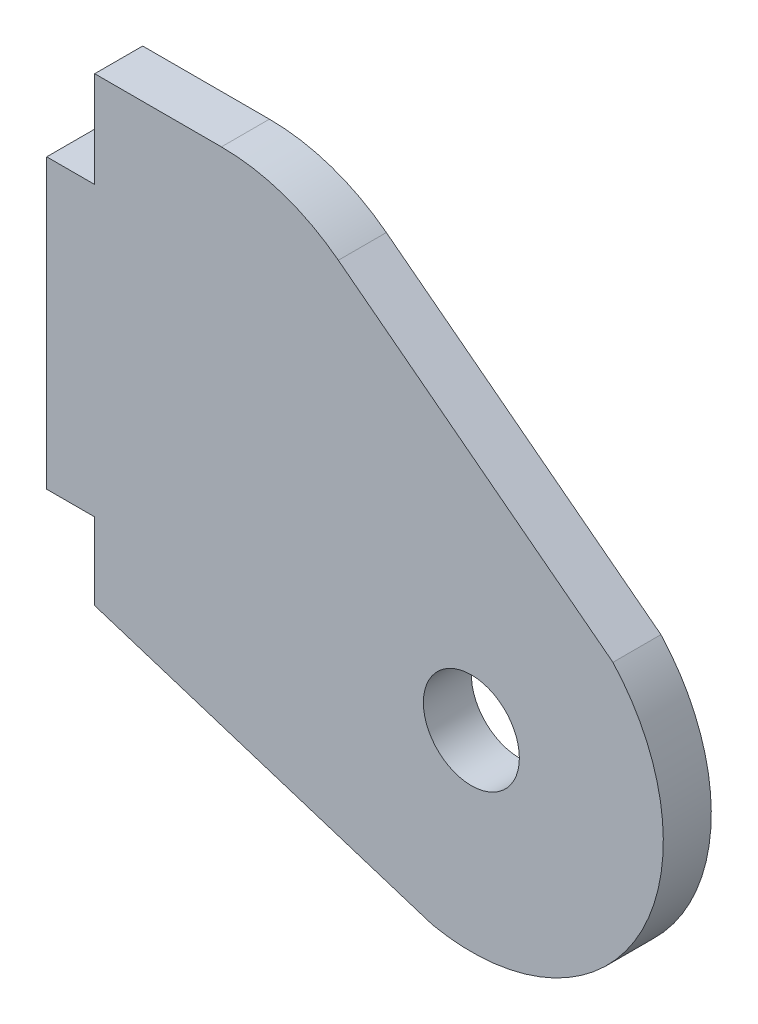
ISO-10303-21;
HEADER;
FILE_DESCRIPTION(('STEP AP214'),'2;1');
FILE_NAME('part.step','',(''),(''),'','','');
FILE_SCHEMA(('AUTOMOTIVE_DESIGN { 1 0 10303 214 1 1 1 1 }'));
ENDSEC;
DATA;
#1=APPLICATION_CONTEXT('core data for automotive mechanical design processes');
#2=APPLICATION_PROTOCOL_DEFINITION('international standard','automotive_design',2000,#1);
#3=PRODUCT_CONTEXT('',#1,'mechanical');
#4=PRODUCT('Part','Part','',(#3));
#5=PRODUCT_RELATED_PRODUCT_CATEGORY('part','',(#4));
#6=PRODUCT_DEFINITION_FORMATION('','',#4);
#7=PRODUCT_DEFINITION_CONTEXT('part definition',#1,'design');
#8=PRODUCT_DEFINITION('design','',#6,#7);
#9=PRODUCT_DEFINITION_SHAPE('','',#8);
#10=(LENGTH_UNIT() NAMED_UNIT(*) SI_UNIT(.MILLI.,.METRE.));
#11=(NAMED_UNIT(*) PLANE_ANGLE_UNIT() SI_UNIT($,.RADIAN.));
#12=(NAMED_UNIT(*) SI_UNIT($,.STERADIAN.) SOLID_ANGLE_UNIT());
#13=UNCERTAINTY_MEASURE_WITH_UNIT(LENGTH_MEASURE(1.E-05),#10,'distance_accuracy_value','');
#14=(GEOMETRIC_REPRESENTATION_CONTEXT(3) GLOBAL_UNCERTAINTY_ASSIGNED_CONTEXT((#13)) GLOBAL_UNIT_ASSIGNED_CONTEXT((#10,
#11,#12)) REPRESENTATION_CONTEXT('',''));
#15=CARTESIAN_POINT('',(0.,0.,0.));
#16=DIRECTION('',(0.,0.,1.));
#17=DIRECTION('',(1.,0.,0.));
#18=AXIS2_PLACEMENT_3D('',#15,#16,#17);
#19=CARTESIAN_POINT('',(-26.2895002274562,-6.08181524735568,-3.175));
#20=DIRECTION('',(1.,0.,0.));
#21=DIRECTION('',(0.,0.,1.));
#22=AXIS2_PLACEMENT_3D('',#19,#20,#21);
#23=PLANE('',#22);
#24=DIRECTION('',(0.,-1.,0.));
#25=VECTOR('',#24,1.);
#26=CARTESIAN_POINT('',(-26.2895002274562,-6.08181524735568,0.));
#27=LINE('',#26,#25);
#28=CARTESIAN_POINT('',(-26.2895002274562,-6.08181524735568,0.));
#29=VERTEX_POINT('',#28);
#30=CARTESIAN_POINT('',(-26.2895002274562,-12.4318152473557,0.));
#31=VERTEX_POINT('',#30);
#32=EDGE_CURVE('E162',#29,#31,#27,.T.);
#33=ORIENTED_EDGE('',*,*,#32,.F.);
#34=DIRECTION('',(0.,0.,1.));
#35=VECTOR('',#34,1.);
#36=CARTESIAN_POINT('',(-26.2895002274562,-6.08181524735568,-3.175));
#37=LINE('',#36,#35);
#38=CARTESIAN_POINT('',(-26.2895002274562,-6.08181524735568,-3.175));
#39=VERTEX_POINT('',#38);
#40=EDGE_CURVE('E135',#39,#29,#37,.T.);
#41=ORIENTED_EDGE('',*,*,#40,.F.);
#42=DIRECTION('',(0.,-1.,0.));
#43=VECTOR('',#42,1.);
#44=CARTESIAN_POINT('',(-26.2895002274562,-6.08181524735568,-3.175));
#45=LINE('',#44,#43);
#46=CARTESIAN_POINT('',(-26.2895002274562,-12.4318152473557,-3.175));
#47=VERTEX_POINT('',#46);
#48=EDGE_CURVE('E115',#39,#47,#45,.T.);
#49=ORIENTED_EDGE('',*,*,#48,.T.);
#50=DIRECTION('',(0.,0.,1.));
#51=VECTOR('',#50,1.);
#52=CARTESIAN_POINT('',(-26.2895002274562,-12.4318152473557,-3.175));
#53=LINE('',#52,#51);
#54=EDGE_CURVE('E124',#47,#31,#53,.T.);
#55=ORIENTED_EDGE('',*,*,#54,.T.);
#56=EDGE_LOOP('',(#33,#41,#49,#55));
#57=FACE_BOUND('',#56,.T.);
#58=ADVANCED_FACE('F37',(#57),#23,.F.);
#59=CARTESIAN_POINT('',(-29.4645002274562,-12.4318152473557,-3.175));
#60=DIRECTION('',(0.,-1.,0.));
#61=DIRECTION('',(0.,0.,1.));
#62=AXIS2_PLACEMENT_3D('',#59,#60,#61);
#63=PLANE('',#62);
#64=DIRECTION('',(-1.,0.,0.));
#65=VECTOR('',#64,1.);
#66=CARTESIAN_POINT('',(-29.4645002274562,-12.4318152473557,0.));
#67=LINE('',#66,#65);
#68=CARTESIAN_POINT('',(-29.4645002274562,-12.4318152473557,0.));
#69=VERTEX_POINT('',#68);
#70=EDGE_CURVE('E127',#31,#69,#67,.T.);
#71=ORIENTED_EDGE('',*,*,#70,.F.);
#72=ORIENTED_EDGE('',*,*,#54,.F.);
#73=DIRECTION('',(-1.,0.,0.));
#74=VECTOR('',#73,1.);
#75=CARTESIAN_POINT('',(-29.4645002274562,-12.4318152473557,-3.175));
#76=LINE('',#75,#74);
#77=CARTESIAN_POINT('',(-29.4645002274562,-12.4318152473557,-3.175));
#78=VERTEX_POINT('',#77);
#79=EDGE_CURVE('E111',#47,#78,#76,.T.);
#80=ORIENTED_EDGE('',*,*,#79,.T.);
#81=DIRECTION('',(0.,0.,1.));
#82=VECTOR('',#81,1.);
#83=CARTESIAN_POINT('',(-29.4645002274562,-12.4318152473557,-3.175));
#84=LINE('',#83,#82);
#85=EDGE_CURVE('E132',#78,#69,#84,.T.);
#86=ORIENTED_EDGE('',*,*,#85,.T.);
#87=EDGE_LOOP('',(#71,#72,#80,#86));
#88=FACE_BOUND('',#87,.T.);
#89=ADVANCED_FACE('F125',(#88),#63,.F.);
#90=CARTESIAN_POINT('',(-29.4645002274562,-31.4818152473557,-3.175));
#91=DIRECTION('',(1.,0.,0.));
#92=DIRECTION('',(0.,0.,1.));
#93=AXIS2_PLACEMENT_3D('',#90,#91,#92);
#94=PLANE('',#93);
#95=DIRECTION('',(0.,-1.,0.));
#96=VECTOR('',#95,1.);
#97=CARTESIAN_POINT('',(-29.4645002274562,-31.4818152473557,0.));
#98=LINE('',#97,#96);
#99=CARTESIAN_POINT('',(-29.4645002274562,-31.4818152473557,0.));
#100=VERTEX_POINT('',#99);
#101=EDGE_CURVE('E165',#69,#100,#98,.T.);
#102=ORIENTED_EDGE('',*,*,#101,.F.);
#103=ORIENTED_EDGE('',*,*,#85,.F.);
#104=DIRECTION('',(0.,-1.,0.));
#105=VECTOR('',#104,1.);
#106=CARTESIAN_POINT('',(-29.4645002274562,-31.4818152473557,-3.175));
#107=LINE('',#106,#105);
#108=CARTESIAN_POINT('',(-29.4645002274562,-31.4818152473557,-3.175));
#109=VERTEX_POINT('',#108);
#110=EDGE_CURVE('E118',#78,#109,#107,.T.);
#111=ORIENTED_EDGE('',*,*,#110,.T.);
#112=DIRECTION('',(0.,0.,1.));
#113=VECTOR('',#112,1.);
#114=CARTESIAN_POINT('',(-29.4645002274562,-31.4818152473557,-3.175));
#115=LINE('',#114,#113);
#116=EDGE_CURVE('E195',#109,#100,#115,.T.);
#117=ORIENTED_EDGE('',*,*,#116,.T.);
#118=EDGE_LOOP('',(#102,#103,#111,#117));
#119=FACE_BOUND('',#118,.T.);
#120=ADVANCED_FACE('F217',(#119),#94,.F.);
#121=CARTESIAN_POINT('',(-26.2895002274562,-31.4818152473557,-3.175));
#122=DIRECTION('',(0.,1.,0.));
#123=DIRECTION('',(0.,0.,-1.));
#124=AXIS2_PLACEMENT_3D('',#121,#122,#123);
#125=PLANE('',#124);
#126=DIRECTION('',(1.,0.,0.));
#127=VECTOR('',#126,1.);
#128=CARTESIAN_POINT('',(-26.2895002274562,-31.4818152473557,0.));
#129=LINE('',#128,#127);
#130=CARTESIAN_POINT('',(-26.2895002274562,-31.4818152473557,0.));
#131=VERTEX_POINT('',#130);
#132=EDGE_CURVE('E168',#100,#131,#129,.T.);
#133=ORIENTED_EDGE('',*,*,#132,.F.);
#134=ORIENTED_EDGE('',*,*,#116,.F.);
#135=DIRECTION('',(1.,0.,0.));
#136=VECTOR('',#135,1.);
#137=CARTESIAN_POINT('',(-26.2895002274562,-31.4818152473557,-3.175));
#138=LINE('',#137,#136);
#139=CARTESIAN_POINT('',(-26.2895002274562,-31.4818152473557,-3.175));
#140=VERTEX_POINT('',#139);
#141=EDGE_CURVE('E145',#109,#140,#138,.T.);
#142=ORIENTED_EDGE('',*,*,#141,.T.);
#143=DIRECTION('',(0.,0.,1.));
#144=VECTOR('',#143,1.);
#145=CARTESIAN_POINT('',(-26.2895002274562,-31.4818152473557,-3.175));
#146=LINE('',#145,#144);
#147=EDGE_CURVE('E192',#140,#131,#146,.T.);
#148=ORIENTED_EDGE('',*,*,#147,.T.);
#149=EDGE_LOOP('',(#133,#134,#142,#148));
#150=FACE_BOUND('',#149,.T.);
#151=ADVANCED_FACE('F215',(#150),#125,.F.);
#152=CARTESIAN_POINT('',(-26.2895002274562,-31.4818152473557,-3.175));
#153=DIRECTION('',(1.,0.,0.));
#154=DIRECTION('',(0.,1.,0.));
#155=AXIS2_PLACEMENT_3D('',#152,#153,#154);
#156=PLANE('',#155);
#157=DIRECTION('',(0.,-1.,0.));
#158=VECTOR('',#157,1.);
#159=CARTESIAN_POINT('',(-26.2895002274562,-31.4818152473557,0.));
#160=LINE('',#159,#158);
#161=CARTESIAN_POINT('',(-26.2895002274562,-36.5618152473557,0.));
#162=VERTEX_POINT('',#161);
#163=EDGE_CURVE('E171',#131,#162,#160,.T.);
#164=ORIENTED_EDGE('',*,*,#163,.F.);
#165=ORIENTED_EDGE('',*,*,#147,.F.);
#166=DIRECTION('',(0.,-1.,0.));
#167=VECTOR('',#166,1.);
#168=CARTESIAN_POINT('',(-26.2895002274562,-31.4818152473557,-3.175));
#169=LINE('',#168,#167);
#170=CARTESIAN_POINT('',(-26.2895002274562,-36.5618152473557,-3.175));
#171=VERTEX_POINT('',#170);
#172=EDGE_CURVE('E148',#140,#171,#169,.T.);
#173=ORIENTED_EDGE('',*,*,#172,.T.);
#174=DIRECTION('',(0.,0.,1.));
#175=VECTOR('',#174,1.);
#176=CARTESIAN_POINT('',(-26.2895002274562,-36.5618152473557,-3.175));
#177=LINE('',#176,#175);
#178=EDGE_CURVE('E189',#171,#162,#177,.T.);
#179=ORIENTED_EDGE('',*,*,#178,.T.);
#180=EDGE_LOOP('',(#164,#165,#173,#179));
#181=FACE_BOUND('',#180,.T.);
#182=ADVANCED_FACE('F212',(#181),#156,.F.);
#183=CARTESIAN_POINT('',(-26.2895002274562,-36.5618152473557,-3.175));
#184=DIRECTION('',(0.303441198287286,0.952850166176181,0.));
#185=DIRECTION('',(-0.952850166176181,0.303441198287286,0.));
#186=AXIS2_PLACEMENT_3D('',#183,#184,#185);
#187=PLANE('',#186);
#188=DIRECTION('',(0.952850166176181,-0.303441198287286,0.));
#189=VECTOR('',#188,1.);
#190=CARTESIAN_POINT('',(-26.2895002274562,-36.5618152473557,0.));
#191=LINE('',#190,#189);
#192=CARTESIAN_POINT('',(-3.93750022745617,-43.6799518703841,0.));
#193=VERTEX_POINT('',#192);
#194=EDGE_CURVE('E174',#162,#193,#191,.T.);
#195=ORIENTED_EDGE('',*,*,#194,.F.);
#196=ORIENTED_EDGE('',*,*,#178,.F.);
#197=DIRECTION('',(0.952850166176181,-0.303441198287286,0.));
#198=VECTOR('',#197,1.);
#199=CARTESIAN_POINT('',(-26.2895002274562,-36.5618152473557,-3.175));
#200=LINE('',#199,#198);
#201=CARTESIAN_POINT('',(-3.93750022745617,-43.6799518703841,-3.175));
#202=VERTEX_POINT('',#201);
#203=EDGE_CURVE('E151',#171,#202,#200,.T.);
#204=ORIENTED_EDGE('',*,*,#203,.T.);
#205=DIRECTION('',(0.,0.,1.));
#206=VECTOR('',#205,1.);
#207=CARTESIAN_POINT('',(-3.93750022745617,-43.6799518703841,-3.175));
#208=LINE('',#207,#206);
#209=EDGE_CURVE('E186',#202,#193,#208,.T.);
#210=ORIENTED_EDGE('',*,*,#209,.T.);
#211=EDGE_LOOP('',(#195,#196,#204,#210));
#212=FACE_BOUND('',#211,.T.);
#213=ADVANCED_FACE('F209',(#212),#187,.F.);
#214=CARTESIAN_POINT('',(-1.36575022745629,-31.2430671343459,-3.175));
#215=DIRECTION('',(0.,0.,1.));
#216=DIRECTION('',(-1.,0.,0.));
#217=AXIS2_PLACEMENT_3D('',#214,#215,#216);
#218=CYLINDRICAL_SURFACE('',#217,12.7);
#219=CARTESIAN_POINT('',(-1.36575022745629,-31.2430671343459,0.));
#220=DIRECTION('',(0.,0.,1.));
#221=DIRECTION('',(-1.,0.,0.));
#222=AXIS2_PLACEMENT_3D('',#219,#220,#221);
#223=CIRCLE('',#222,12.7);
#224=CARTESIAN_POINT('',(8.00049977254384,-22.6661585457286,0.));
#225=VERTEX_POINT('',#224);
#226=EDGE_CURVE('E177',#193,#225,#223,.T.);
#227=ORIENTED_EDGE('',*,*,#226,.F.);
#228=ORIENTED_EDGE('',*,*,#209,.F.);
#229=CARTESIAN_POINT('',(-1.36575022745629,-31.2430671343459,-3.175));
#230=DIRECTION('',(0.,0.,1.));
#231=DIRECTION('',(-1.,0.,0.));
#232=AXIS2_PLACEMENT_3D('',#229,#230,#231);
#233=CIRCLE('',#232,12.7);
#234=CARTESIAN_POINT('',(8.00049977254384,-22.6661585457286,-3.175));
#235=VERTEX_POINT('',#234);
#236=EDGE_CURVE('E154',#202,#235,#233,.T.);
#237=ORIENTED_EDGE('',*,*,#236,.T.);
#238=DIRECTION('',(0.,0.,1.));
#239=VECTOR('',#238,1.);
#240=CARTESIAN_POINT('',(8.00049977254384,-22.6661585457286,-3.175));
#241=LINE('',#240,#239);
#242=EDGE_CURVE('E183',#235,#225,#241,.T.);
#243=ORIENTED_EDGE('',*,*,#242,.T.);
#244=EDGE_LOOP('',(#227,#228,#237,#243));
#245=FACE_BOUND('',#244,.T.);
#246=ADVANCED_FACE('F207',(#245),#218,.T.);
#247=CARTESIAN_POINT('',(-13.5895002274562,-6.08181524735568,-3.175));
#248=DIRECTION('',(-0.609171799118422,-0.793038283539215,0.));
#249=DIRECTION('',(0.793038283539216,-0.609171799118422,0.));
#250=AXIS2_PLACEMENT_3D('',#247,#248,#249);
#251=PLANE('',#250);
#252=DIRECTION('',(-0.793038283539215,0.609171799118422,0.));
#253=VECTOR('',#252,1.);
#254=CARTESIAN_POINT('',(-13.5895002274562,-6.08181524735568,0.));
#255=LINE('',#254,#253);
#256=CARTESIAN_POINT('',(-10.1677515998153,-8.71022904640765,0.));
#257=VERTEX_POINT('',#256);
#258=EDGE_CURVE('E138',#225,#257,#255,.T.);
#259=ORIENTED_EDGE('',*,*,#258,.F.);
#260=ORIENTED_EDGE('',*,*,#242,.F.);
#261=DIRECTION('',(-0.793038283539215,0.609171799118422,0.));
#262=VECTOR('',#261,1.);
#263=CARTESIAN_POINT('',(-13.5895002274562,-6.08181524735568,-3.175));
#264=LINE('',#263,#262);
#265=CARTESIAN_POINT('',(-10.1677515998153,-8.71022904640765,-3.175));
#266=VERTEX_POINT('',#265);
#267=EDGE_CURVE('E157',#235,#266,#264,.T.);
#268=ORIENTED_EDGE('',*,*,#267,.T.);
#269=DIRECTION('',(0.,0.,1.));
#270=VECTOR('',#269,1.);
#271=CARTESIAN_POINT('',(-10.1677515998153,-8.71022904640765,-3.175));
#272=LINE('',#271,#270);
#273=EDGE_CURVE('E45',#257,#266,#272,.F.);
#274=ORIENTED_EDGE('',*,*,#273,.F.);
#275=EDGE_LOOP('',(#259,#260,#268,#274));
#276=FACE_BOUND('',#275,.T.);
#277=ADVANCED_FACE('F203',(#276),#251,.F.);
#278=CARTESIAN_POINT('',(-26.2895002274562,-6.08181524735568,-3.175));
#279=DIRECTION('',(0.,-1.,0.));
#280=DIRECTION('',(0.,0.,1.));
#281=AXIS2_PLACEMENT_3D('',#278,#279,#280);
#282=PLANE('',#281);
#283=DIRECTION('',(-1.,0.,0.));
#284=VECTOR('',#283,1.);
#285=CARTESIAN_POINT('',(-26.2895002274562,-6.08181524735568,-3.175));
#286=LINE('',#285,#284);
#287=CARTESIAN_POINT('',(-17.9042334486193,-6.08181524735568,-3.175));
#288=VERTEX_POINT('',#287);
#289=EDGE_CURVE('E160',#288,#39,#286,.T.);
#290=ORIENTED_EDGE('',*,*,#289,.T.);
#291=ORIENTED_EDGE('',*,*,#40,.T.);
#292=DIRECTION('',(-1.,0.,0.));
#293=VECTOR('',#292,1.);
#294=CARTESIAN_POINT('',(-26.2895002274562,-6.08181524735568,0.));
#295=LINE('',#294,#293);
#296=CARTESIAN_POINT('',(-17.9042334486193,-6.08181524735568,0.));
#297=VERTEX_POINT('',#296);
#298=EDGE_CURVE('E136',#297,#29,#295,.T.);
#299=ORIENTED_EDGE('',*,*,#298,.F.);
#300=DIRECTION('',(0.,0.,1.));
#301=VECTOR('',#300,1.);
#302=CARTESIAN_POINT('',(-17.9042334486193,-6.08181524735568,-3.175));
#303=LINE('',#302,#301);
#304=EDGE_CURVE('E131',#288,#297,#303,.T.);
#305=ORIENTED_EDGE('',*,*,#304,.F.);
#306=EDGE_LOOP('',(#290,#291,#299,#305));
#307=FACE_BOUND('',#306,.T.);
#308=ADVANCED_FACE('F222',(#307),#282,.F.);
#309=CARTESIAN_POINT('',(-1.36575022745629,-31.2430671343459,-3.175));
#310=DIRECTION('',(0.,0.,1.));
#311=DIRECTION('',(-1.,0.,0.));
#312=AXIS2_PLACEMENT_3D('',#309,#310,#311);
#313=PLANE('',#312);
#314=CARTESIAN_POINT('',(-1.36575022745629,-31.2430671343459,-3.175));
#315=DIRECTION('',(0.,0.,1.));
#316=DIRECTION('',(1.,0.,0.));
#317=AXIS2_PLACEMENT_3D('',#314,#315,#316);
#318=CIRCLE('',#317,3.175);
#319=CARTESIAN_POINT('',(1.80924977254371,-31.2430671343459,-3.175));
#320=VERTEX_POINT('',#319);
#321=EDGE_CURVE('E300',#320,#320,#318,.T.);
#322=ORIENTED_EDGE('',*,*,#321,.T.);
#323=EDGE_LOOP('',(#322));
#324=FACE_BOUND('',#323,.T.);
#325=ORIENTED_EDGE('',*,*,#267,.F.);
#326=ORIENTED_EDGE('',*,*,#236,.F.);
#327=ORIENTED_EDGE('',*,*,#203,.F.);
#328=ORIENTED_EDGE('',*,*,#172,.F.);
#329=ORIENTED_EDGE('',*,*,#141,.F.);
#330=ORIENTED_EDGE('',*,*,#110,.F.);
#331=ORIENTED_EDGE('',*,*,#79,.F.);
#332=ORIENTED_EDGE('',*,*,#48,.F.);
#333=ORIENTED_EDGE('',*,*,#289,.F.);
#334=CARTESIAN_POINT('',(-17.9042334486193,-18.7818152473557,-3.175));
#335=DIRECTION('',(0.,0.,-1.));
#336=DIRECTION('',(-1.,0.,0.));
#337=AXIS2_PLACEMENT_3D('',#334,#335,#336);
#338=CIRCLE('',#337,12.7);
#339=EDGE_CURVE('E11',#266,#288,#338,.F.);
#340=ORIENTED_EDGE('',*,*,#339,.F.);
#341=EDGE_LOOP('',(#325,#326,#327,#328,#329,#330,#331,#332,#333,#340));
#342=FACE_BOUND('',#341,.T.);
#343=ADVANCED_FACE('F113',(#324,#342),#313,.F.);
#344=CARTESIAN_POINT('',(-1.36575022745629,-31.2430671343459,0.));
#345=DIRECTION('',(0.,0.,1.));
#346=DIRECTION('',(-1.,0.,0.));
#347=AXIS2_PLACEMENT_3D('',#344,#345,#346);
#348=PLANE('',#347);
#349=CARTESIAN_POINT('',(-1.36575022745629,-31.2430671343459,0.));
#350=DIRECTION('',(0.,0.,-1.));
#351=DIRECTION('',(-1.,0.,0.));
#352=AXIS2_PLACEMENT_3D('',#349,#350,#351);
#353=CIRCLE('',#352,3.175);
#354=CARTESIAN_POINT('',(-4.54075022745629,-31.2430671343459,0.));
#355=VERTEX_POINT('',#354);
#356=EDGE_CURVE('E141',#355,#355,#353,.T.);
#357=ORIENTED_EDGE('',*,*,#356,.T.);
#358=EDGE_LOOP('',(#357));
#359=FACE_BOUND('',#358,.T.);
#360=ORIENTED_EDGE('',*,*,#298,.T.);
#361=ORIENTED_EDGE('',*,*,#32,.T.);
#362=ORIENTED_EDGE('',*,*,#70,.T.);
#363=ORIENTED_EDGE('',*,*,#101,.T.);
#364=ORIENTED_EDGE('',*,*,#132,.T.);
#365=ORIENTED_EDGE('',*,*,#163,.T.);
#366=ORIENTED_EDGE('',*,*,#194,.T.);
#367=ORIENTED_EDGE('',*,*,#226,.T.);
#368=ORIENTED_EDGE('',*,*,#258,.T.);
#369=CARTESIAN_POINT('',(-17.9042334486193,-18.7818152473557,0.));
#370=DIRECTION('',(0.,0.,-1.));
#371=DIRECTION('',(-1.,0.,0.));
#372=AXIS2_PLACEMENT_3D('',#369,#370,#371);
#373=CIRCLE('',#372,12.7);
#374=EDGE_CURVE('E57',#297,#257,#373,.T.);
#375=ORIENTED_EDGE('',*,*,#374,.F.);
#376=EDGE_LOOP('',(#360,#361,#362,#363,#364,#365,#366,#367,#368,#375));
#377=FACE_BOUND('',#376,.T.);
#378=ADVANCED_FACE('F219',(#359,#377),#348,.T.);
#379=CARTESIAN_POINT('',(-1.36575022745629,-31.2430671343459,-3.175));
#380=DIRECTION('',(0.,0.,-1.));
#381=DIRECTION('',(1.,0.,0.));
#382=AXIS2_PLACEMENT_3D('',#379,#380,#381);
#383=CYLINDRICAL_SURFACE('',#382,3.175);
#384=ORIENTED_EDGE('',*,*,#356,.F.);
#385=EDGE_LOOP('',(#384));
#386=FACE_BOUND('',#385,.T.);
#387=ORIENTED_EDGE('',*,*,#321,.F.);
#388=EDGE_LOOP('',(#387));
#389=FACE_BOUND('',#388,.T.);
#390=ADVANCED_FACE('F275',(#386,#389),#383,.F.);
#391=CARTESIAN_POINT('',(-17.9042334486193,-18.7818152473557,-3.175));
#392=DIRECTION('',(0.,0.,1.));
#393=DIRECTION('',(-1.,0.,0.));
#394=AXIS2_PLACEMENT_3D('',#391,#392,#393);
#395=CYLINDRICAL_SURFACE('',#394,12.7);
#396=ORIENTED_EDGE('',*,*,#339,.T.);
#397=ORIENTED_EDGE('',*,*,#304,.T.);
#398=ORIENTED_EDGE('',*,*,#374,.T.);
#399=ORIENTED_EDGE('',*,*,#273,.T.);
#400=EDGE_LOOP('',(#396,#397,#398,#399));
#401=FACE_BOUND('',#400,.T.);
#402=ADVANCED_FACE('F39',(#401),#395,.T.);
#403=CLOSED_SHELL('',(#58,#89,#120,#151,#182,#213,#246,#277,#308,#343,#378,#390,#402));
#404=MANIFOLD_SOLID_BREP('B2',#403);
#405=ADVANCED_BREP_SHAPE_REPRESENTATION('',(#18,#404),#14);
#406=SHAPE_DEFINITION_REPRESENTATION(#9,#405);
ENDSEC;
END-ISO-10303-21;
